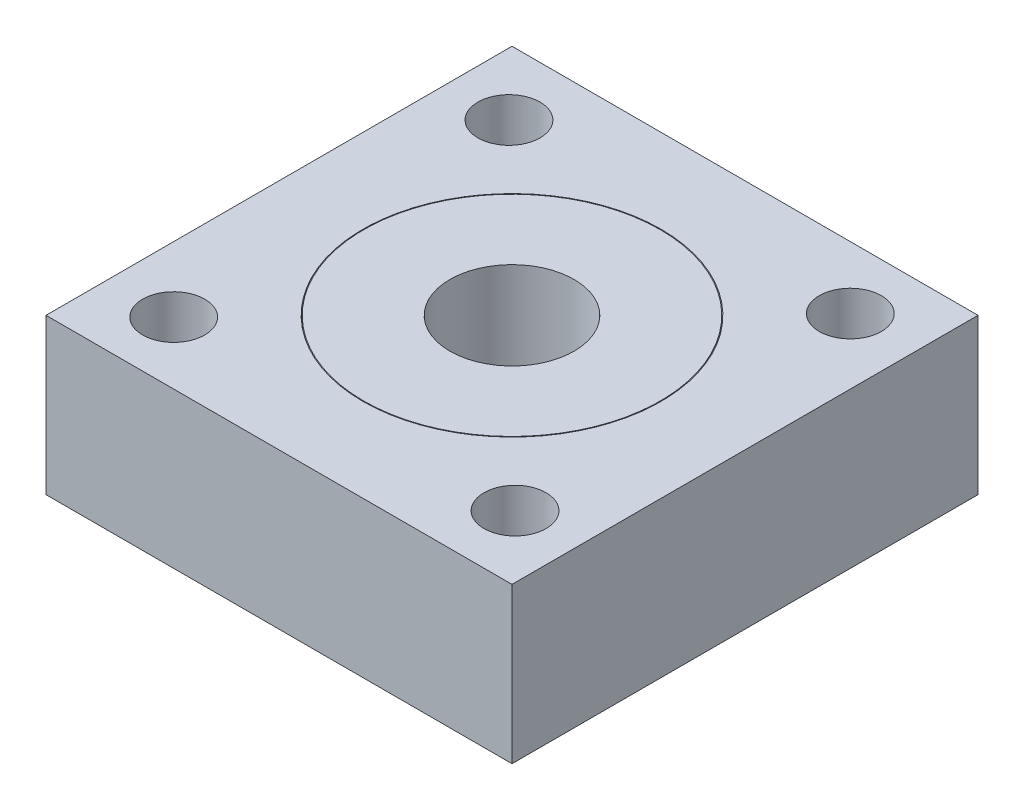
ISO-10303-21;
HEADER;
FILE_DESCRIPTION(('STEP AP214'),'2;1');
FILE_NAME('part.step','',(''),(''),'','','');
FILE_SCHEMA(('AUTOMOTIVE_DESIGN { 1 0 10303 214 1 1 1 1 }'));
ENDSEC;
DATA;
#1=APPLICATION_CONTEXT('core data for automotive mechanical design processes');
#2=APPLICATION_PROTOCOL_DEFINITION('international standard','automotive_design',2000,#1);
#3=PRODUCT_CONTEXT('',#1,'mechanical');
#4=PRODUCT('Part','Part','',(#3));
#5=PRODUCT_RELATED_PRODUCT_CATEGORY('part','',(#4));
#6=PRODUCT_DEFINITION_FORMATION('','',#4);
#7=PRODUCT_DEFINITION_CONTEXT('part definition',#1,'design');
#8=PRODUCT_DEFINITION('design','',#6,#7);
#9=PRODUCT_DEFINITION_SHAPE('','',#8);
#10=(LENGTH_UNIT() NAMED_UNIT(*) SI_UNIT(.MILLI.,.METRE.));
#11=(NAMED_UNIT(*) PLANE_ANGLE_UNIT() SI_UNIT($,.RADIAN.));
#12=(NAMED_UNIT(*) SI_UNIT($,.STERADIAN.) SOLID_ANGLE_UNIT());
#13=UNCERTAINTY_MEASURE_WITH_UNIT(LENGTH_MEASURE(1.E-05),#10,'distance_accuracy_value','');
#14=(GEOMETRIC_REPRESENTATION_CONTEXT(3) GLOBAL_UNCERTAINTY_ASSIGNED_CONTEXT((#13)) GLOBAL_UNIT_ASSIGNED_CONTEXT((#10,
#11,#12)) REPRESENTATION_CONTEXT('',''));
#15=CARTESIAN_POINT('',(0.,0.,0.));
#16=DIRECTION('',(0.,0.,1.));
#17=DIRECTION('',(1.,0.,0.));
#18=AXIS2_PLACEMENT_3D('',#15,#16,#17);
#19=CARTESIAN_POINT('',(15.,10.,-15.));
#20=DIRECTION('',(-1.,0.,0.));
#21=DIRECTION('',(0.,0.,1.));
#22=AXIS2_PLACEMENT_3D('',#19,#20,#21);
#23=PLANE('',#22);
#24=DIRECTION('',(0.,0.,-1.));
#25=VECTOR('',#24,1.);
#26=CARTESIAN_POINT('',(15.,0.,-15.));
#27=LINE('',#26,#25);
#28=CARTESIAN_POINT('',(15.,0.,15.));
#29=VERTEX_POINT('',#28);
#30=CARTESIAN_POINT('',(15.,0.,-15.));
#31=VERTEX_POINT('',#30);
#32=EDGE_CURVE('E101',#29,#31,#27,.T.);
#33=ORIENTED_EDGE('',*,*,#32,.T.);
#34=DIRECTION('',(0.,-1.,0.));
#35=VECTOR('',#34,1.);
#36=CARTESIAN_POINT('',(15.,10.,-15.));
#37=LINE('',#36,#35);
#38=CARTESIAN_POINT('',(15.,10.,-15.));
#39=VERTEX_POINT('',#38);
#40=EDGE_CURVE('E11',#39,#31,#37,.T.);
#41=ORIENTED_EDGE('',*,*,#40,.F.);
#42=DIRECTION('',(0.,0.,-1.));
#43=VECTOR('',#42,1.);
#44=CARTESIAN_POINT('',(15.,10.,-15.));
#45=LINE('',#44,#43);
#46=CARTESIAN_POINT('',(15.,10.,15.));
#47=VERTEX_POINT('',#46);
#48=EDGE_CURVE('E89',#47,#39,#45,.T.);
#49=ORIENTED_EDGE('',*,*,#48,.F.);
#50=DIRECTION('',(0.,-1.,0.));
#51=VECTOR('',#50,1.);
#52=CARTESIAN_POINT('',(15.,10.,15.));
#53=LINE('',#52,#51);
#54=EDGE_CURVE('E97',#47,#29,#53,.T.);
#55=ORIENTED_EDGE('',*,*,#54,.T.);
#56=EDGE_LOOP('',(#33,#41,#49,#55));
#57=FACE_BOUND('',#56,.T.);
#58=ADVANCED_FACE('F38',(#57),#23,.F.);
#59=CARTESIAN_POINT('',(-15.,10.,-15.));
#60=DIRECTION('',(0.,0.,1.));
#61=DIRECTION('',(1.,0.,0.));
#62=AXIS2_PLACEMENT_3D('',#59,#60,#61);
#63=PLANE('',#62);
#64=DIRECTION('',(-1.,0.,0.));
#65=VECTOR('',#64,1.);
#66=CARTESIAN_POINT('',(-15.,0.,-15.));
#67=LINE('',#66,#65);
#68=CARTESIAN_POINT('',(-15.,0.,-15.));
#69=VERTEX_POINT('',#68);
#70=EDGE_CURVE('E93',#31,#69,#67,.T.);
#71=ORIENTED_EDGE('',*,*,#70,.T.);
#72=DIRECTION('',(0.,-1.,0.));
#73=VECTOR('',#72,1.);
#74=CARTESIAN_POINT('',(-15.,10.,-15.));
#75=LINE('',#74,#73);
#76=CARTESIAN_POINT('',(-15.,10.,-15.));
#77=VERTEX_POINT('',#76);
#78=EDGE_CURVE('E46',#77,#69,#75,.T.);
#79=ORIENTED_EDGE('',*,*,#78,.F.);
#80=DIRECTION('',(-1.,0.,0.));
#81=VECTOR('',#80,1.);
#82=CARTESIAN_POINT('',(-15.,10.,-15.));
#83=LINE('',#82,#81);
#84=EDGE_CURVE('E84',#39,#77,#83,.T.);
#85=ORIENTED_EDGE('',*,*,#84,.F.);
#86=ORIENTED_EDGE('',*,*,#40,.T.);
#87=EDGE_LOOP('',(#71,#79,#85,#86));
#88=FACE_BOUND('',#87,.T.);
#89=ADVANCED_FACE('F92',(#88),#63,.F.);
#90=CARTESIAN_POINT('',(-15.,10.,-15.));
#91=DIRECTION('',(1.,0.,0.));
#92=DIRECTION('',(0.,0.,-1.));
#93=AXIS2_PLACEMENT_3D('',#90,#91,#92);
#94=PLANE('',#93);
#95=DIRECTION('',(0.,0.,1.));
#96=VECTOR('',#95,1.);
#97=CARTESIAN_POINT('',(-15.,0.,-15.));
#98=LINE('',#97,#96);
#99=CARTESIAN_POINT('',(-15.,0.,15.));
#100=VERTEX_POINT('',#99);
#101=EDGE_CURVE('E71',#69,#100,#98,.T.);
#102=ORIENTED_EDGE('',*,*,#101,.T.);
#103=DIRECTION('',(0.,-1.,0.));
#104=VECTOR('',#103,1.);
#105=CARTESIAN_POINT('',(-15.,10.,15.));
#106=LINE('',#105,#104);
#107=CARTESIAN_POINT('',(-15.,10.,15.));
#108=VERTEX_POINT('',#107);
#109=EDGE_CURVE('E94',#108,#100,#106,.T.);
#110=ORIENTED_EDGE('',*,*,#109,.F.);
#111=DIRECTION('',(0.,0.,1.));
#112=VECTOR('',#111,1.);
#113=CARTESIAN_POINT('',(-15.,10.,-15.));
#114=LINE('',#113,#112);
#115=EDGE_CURVE('E87',#77,#108,#114,.T.);
#116=ORIENTED_EDGE('',*,*,#115,.F.);
#117=ORIENTED_EDGE('',*,*,#78,.T.);
#118=EDGE_LOOP('',(#102,#110,#116,#117));
#119=FACE_BOUND('',#118,.T.);
#120=ADVANCED_FACE('F95',(#119),#94,.F.);
#121=CARTESIAN_POINT('',(-15.,10.,15.));
#122=DIRECTION('',(0.,0.,-1.));
#123=DIRECTION('',(-1.,0.,0.));
#124=AXIS2_PLACEMENT_3D('',#121,#122,#123);
#125=PLANE('',#124);
#126=DIRECTION('',(1.,0.,0.));
#127=VECTOR('',#126,1.);
#128=CARTESIAN_POINT('',(-15.,0.,15.));
#129=LINE('',#128,#127);
#130=EDGE_CURVE('E77',#100,#29,#129,.T.);
#131=ORIENTED_EDGE('',*,*,#130,.T.);
#132=ORIENTED_EDGE('',*,*,#54,.F.);
#133=DIRECTION('',(1.,0.,0.));
#134=VECTOR('',#133,1.);
#135=CARTESIAN_POINT('',(-15.,10.,15.));
#136=LINE('',#135,#134);
#137=EDGE_CURVE('E54',#108,#47,#136,.T.);
#138=ORIENTED_EDGE('',*,*,#137,.F.);
#139=ORIENTED_EDGE('',*,*,#109,.T.);
#140=EDGE_LOOP('',(#131,#132,#138,#139));
#141=FACE_BOUND('',#140,.T.);
#142=ADVANCED_FACE('F109',(#141),#125,.F.);
#143=CARTESIAN_POINT('',(0.,10.,0.));
#144=DIRECTION('',(0.,1.,0.));
#145=DIRECTION('',(0.,0.,1.));
#146=AXIS2_PLACEMENT_3D('',#143,#144,#145);
#147=PLANE('',#146);
#148=CARTESIAN_POINT('',(-10.9875097580016,10.,-10.7923497267759));
#149=DIRECTION('',(0.,1.,0.));
#150=DIRECTION('',(1.,0.,0.));
#151=AXIS2_PLACEMENT_3D('',#148,#149,#150);
#152=CIRCLE('',#151,2.);
#153=CARTESIAN_POINT('',(-8.98750975800163,10.,-10.7923497267759));
#154=VERTEX_POINT('',#153);
#155=EDGE_CURVE('E136',#154,#154,#152,.T.);
#156=ORIENTED_EDGE('',*,*,#155,.F.);
#157=EDGE_LOOP('',(#156));
#158=FACE_BOUND('',#157,.T.);
#159=CARTESIAN_POINT('',(-10.792349726776,10.,10.9875097580016));
#160=DIRECTION('',(0.,1.,0.));
#161=DIRECTION('',(0.,0.,-1.));
#162=AXIS2_PLACEMENT_3D('',#159,#160,#161);
#163=CIRCLE('',#162,2.);
#164=CARTESIAN_POINT('',(-10.792349726776,10.,8.9875097580016));
#165=VERTEX_POINT('',#164);
#166=EDGE_CURVE('E146',#165,#165,#163,.T.);
#167=ORIENTED_EDGE('',*,*,#166,.F.);
#168=EDGE_LOOP('',(#167));
#169=FACE_BOUND('',#168,.T.);
#170=CARTESIAN_POINT('',(10.9875097580017,10.,10.7923497267758));
#171=DIRECTION('',(0.,1.,0.));
#172=DIRECTION('',(-1.,0.,0.));
#173=AXIS2_PLACEMENT_3D('',#170,#171,#172);
#174=CIRCLE('',#173,2.);
#175=CARTESIAN_POINT('',(8.98750975800171,10.,10.7923497267759));
#176=VERTEX_POINT('',#175);
#177=EDGE_CURVE('E139',#176,#176,#174,.T.);
#178=ORIENTED_EDGE('',*,*,#177,.F.);
#179=EDGE_LOOP('',(#178));
#180=FACE_BOUND('',#179,.T.);
#181=CARTESIAN_POINT('',(10.792349726776,10.,-10.9875097580016));
#182=DIRECTION('',(0.,1.,0.));
#183=DIRECTION('',(0.,0.,1.));
#184=AXIS2_PLACEMENT_3D('',#181,#182,#183);
#185=CIRCLE('',#184,2.);
#186=CARTESIAN_POINT('',(10.792349726776,10.,-8.9875097580016));
#187=VERTEX_POINT('',#186);
#188=EDGE_CURVE('E133',#187,#187,#185,.T.);
#189=ORIENTED_EDGE('',*,*,#188,.F.);
#190=EDGE_LOOP('',(#189));
#191=FACE_BOUND('',#190,.T.);
#192=CARTESIAN_POINT('',(0.,10.,0.));
#193=DIRECTION('',(0.,1.,0.));
#194=DIRECTION('',(0.,0.,1.));
#195=AXIS2_PLACEMENT_3D('',#192,#193,#194);
#196=CIRCLE('',#195,9.6);
#197=CARTESIAN_POINT('',(0.,10.,9.6));
#198=VERTEX_POINT('',#197);
#199=EDGE_CURVE('E115',#198,#198,#196,.T.);
#200=ORIENTED_EDGE('',*,*,#199,.F.);
#201=EDGE_LOOP('',(#200));
#202=FACE_BOUND('',#201,.T.);
#203=ORIENTED_EDGE('',*,*,#48,.T.);
#204=ORIENTED_EDGE('',*,*,#84,.T.);
#205=ORIENTED_EDGE('',*,*,#115,.T.);
#206=ORIENTED_EDGE('',*,*,#137,.T.);
#207=EDGE_LOOP('',(#203,#204,#205,#206));
#208=FACE_BOUND('',#207,.T.);
#209=ADVANCED_FACE('F85',(#158,#169,#180,#191,#202,#208),#147,.T.);
#210=CARTESIAN_POINT('',(0.,0.,0.));
#211=DIRECTION('',(0.,1.,0.));
#212=DIRECTION('',(0.,0.,1.));
#213=AXIS2_PLACEMENT_3D('',#210,#211,#212);
#214=PLANE('',#213);
#215=CARTESIAN_POINT('',(-10.9875097580016,0.,-10.7923497267759));
#216=DIRECTION('',(0.,1.,0.));
#217=DIRECTION('',(1.,0.,0.));
#218=AXIS2_PLACEMENT_3D('',#215,#216,#217);
#219=CIRCLE('',#218,2.);
#220=CARTESIAN_POINT('',(-8.98750975800163,0.,-10.7923497267759));
#221=VERTEX_POINT('',#220);
#222=EDGE_CURVE('E149',#221,#221,#219,.T.);
#223=ORIENTED_EDGE('',*,*,#222,.T.);
#224=EDGE_LOOP('',(#223));
#225=FACE_BOUND('',#224,.T.);
#226=CARTESIAN_POINT('',(-10.792349726776,0.,10.9875097580016));
#227=DIRECTION('',(0.,1.,0.));
#228=DIRECTION('',(0.,0.,-1.));
#229=AXIS2_PLACEMENT_3D('',#226,#227,#228);
#230=CIRCLE('',#229,2.);
#231=CARTESIAN_POINT('',(-10.792349726776,0.,8.9875097580016));
#232=VERTEX_POINT('',#231);
#233=EDGE_CURVE('E142',#232,#232,#230,.T.);
#234=ORIENTED_EDGE('',*,*,#233,.T.);
#235=EDGE_LOOP('',(#234));
#236=FACE_BOUND('',#235,.T.);
#237=CARTESIAN_POINT('',(10.9875097580017,0.,10.7923497267758));
#238=DIRECTION('',(0.,1.,0.));
#239=DIRECTION('',(-1.,0.,0.));
#240=AXIS2_PLACEMENT_3D('',#237,#238,#239);
#241=CIRCLE('',#240,2.);
#242=CARTESIAN_POINT('',(8.98750975800171,0.,10.7923497267759));
#243=VERTEX_POINT('',#242);
#244=EDGE_CURVE('E143',#243,#243,#241,.T.);
#245=ORIENTED_EDGE('',*,*,#244,.T.);
#246=EDGE_LOOP('',(#245));
#247=FACE_BOUND('',#246,.T.);
#248=CARTESIAN_POINT('',(10.792349726776,0.,-10.9875097580016));
#249=DIRECTION('',(0.,1.,0.));
#250=DIRECTION('',(0.,0.,1.));
#251=AXIS2_PLACEMENT_3D('',#248,#249,#250);
#252=CIRCLE('',#251,2.);
#253=CARTESIAN_POINT('',(10.792349726776,0.,-8.9875097580016));
#254=VERTEX_POINT('',#253);
#255=EDGE_CURVE('E130',#254,#254,#252,.T.);
#256=ORIENTED_EDGE('',*,*,#255,.T.);
#257=EDGE_LOOP('',(#256));
#258=FACE_BOUND('',#257,.T.);
#259=ORIENTED_EDGE('',*,*,#32,.F.);
#260=ORIENTED_EDGE('',*,*,#130,.F.);
#261=ORIENTED_EDGE('',*,*,#101,.F.);
#262=ORIENTED_EDGE('',*,*,#70,.F.);
#263=EDGE_LOOP('',(#259,#260,#261,#262));
#264=FACE_BOUND('',#263,.T.);
#265=ADVANCED_FACE('F112',(#225,#236,#247,#258,#264),#214,.F.);
#266=CARTESIAN_POINT('',(0.,3.,0.));
#267=DIRECTION('',(0.,1.,0.));
#268=DIRECTION('',(0.,0.,1.));
#269=AXIS2_PLACEMENT_3D('',#266,#267,#268);
#270=CYLINDRICAL_SURFACE('',#269,9.6);
#271=CARTESIAN_POINT('',(0.,3.,0.));
#272=DIRECTION('',(0.,1.,0.));
#273=DIRECTION('',(0.,0.,1.));
#274=AXIS2_PLACEMENT_3D('',#271,#272,#273);
#275=CIRCLE('',#274,9.6);
#276=CARTESIAN_POINT('',(0.,3.,9.6));
#277=VERTEX_POINT('',#276);
#278=EDGE_CURVE('E104',#277,#277,#275,.T.);
#279=ORIENTED_EDGE('',*,*,#278,.F.);
#280=EDGE_LOOP('',(#279));
#281=FACE_BOUND('',#280,.T.);
#282=ORIENTED_EDGE('',*,*,#199,.T.);
#283=EDGE_LOOP('',(#282));
#284=FACE_BOUND('',#283,.T.);
#285=ADVANCED_FACE('F178',(#281,#284),#270,.F.);
#286=CARTESIAN_POINT('',(0.,3.,0.));
#287=DIRECTION('',(0.,1.,0.));
#288=DIRECTION('',(0.,0.,1.));
#289=AXIS2_PLACEMENT_3D('',#286,#287,#288);
#290=PLANE('',#289);
#291=CARTESIAN_POINT('',(0.,3.,0.));
#292=DIRECTION('',(0.,1.,0.));
#293=DIRECTION('',(0.,0.,1.));
#294=AXIS2_PLACEMENT_3D('',#291,#292,#293);
#295=CIRCLE('',#294,9.55);
#296=CARTESIAN_POINT('',(0.,3.,9.55));
#297=VERTEX_POINT('',#296);
#298=EDGE_CURVE('E118',#297,#297,#295,.T.);
#299=ORIENTED_EDGE('',*,*,#298,.F.);
#300=EDGE_LOOP('',(#299));
#301=FACE_BOUND('',#300,.T.);
#302=ORIENTED_EDGE('',*,*,#278,.T.);
#303=EDGE_LOOP('',(#302));
#304=FACE_BOUND('',#303,.T.);
#305=ADVANCED_FACE('F180',(#301,#304),#290,.T.);
#306=CARTESIAN_POINT('',(0.,3.,0.));
#307=DIRECTION('',(0.,1.,0.));
#308=DIRECTION('',(0.,0.,1.));
#309=AXIS2_PLACEMENT_3D('',#306,#307,#308);
#310=CYLINDRICAL_SURFACE('',#309,9.55);
#311=ORIENTED_EDGE('',*,*,#298,.T.);
#312=EDGE_LOOP('',(#311));
#313=FACE_BOUND('',#312,.T.);
#314=CARTESIAN_POINT('',(0.,10.,0.));
#315=DIRECTION('',(0.,1.,0.));
#316=DIRECTION('',(0.,0.,1.));
#317=AXIS2_PLACEMENT_3D('',#314,#315,#316);
#318=CIRCLE('',#317,9.55);
#319=CARTESIAN_POINT('',(0.,10.,9.55));
#320=VERTEX_POINT('',#319);
#321=EDGE_CURVE('E121',#320,#320,#318,.T.);
#322=ORIENTED_EDGE('',*,*,#321,.F.);
#323=EDGE_LOOP('',(#322));
#324=FACE_BOUND('',#323,.T.);
#325=ADVANCED_FACE('F187',(#313,#324),#310,.T.);
#326=CARTESIAN_POINT('',(0.,10.,0.));
#327=DIRECTION('',(0.,1.,0.));
#328=DIRECTION('',(0.,0.,1.));
#329=AXIS2_PLACEMENT_3D('',#326,#327,#328);
#330=CIRCLE('',#329,4.);
#331=CARTESIAN_POINT('',(0.,10.,4.));
#332=VERTEX_POINT('',#331);
#333=EDGE_CURVE('E127',#332,#332,#330,.T.);
#334=ORIENTED_EDGE('',*,*,#333,.F.);
#335=EDGE_LOOP('',(#334));
#336=FACE_BOUND('',#335,.T.);
#337=ORIENTED_EDGE('',*,*,#321,.T.);
#338=EDGE_LOOP('',(#337));
#339=FACE_BOUND('',#338,.T.);
#340=ADVANCED_FACE('F169',(#336,#339),#147,.T.);
#341=CARTESIAN_POINT('',(0.,3.,0.));
#342=DIRECTION('',(0.,1.,0.));
#343=DIRECTION('',(0.,0.,1.));
#344=AXIS2_PLACEMENT_3D('',#341,#342,#343);
#345=CYLINDRICAL_SURFACE('',#344,4.);
#346=CARTESIAN_POINT('',(0.,3.,0.));
#347=DIRECTION('',(0.,1.,0.));
#348=DIRECTION('',(0.,0.,1.));
#349=AXIS2_PLACEMENT_3D('',#346,#347,#348);
#350=CIRCLE('',#349,4.);
#351=CARTESIAN_POINT('',(0.,3.,4.));
#352=VERTEX_POINT('',#351);
#353=EDGE_CURVE('E124',#352,#352,#350,.T.);
#354=ORIENTED_EDGE('',*,*,#353,.F.);
#355=EDGE_LOOP('',(#354));
#356=FACE_BOUND('',#355,.T.);
#357=ORIENTED_EDGE('',*,*,#333,.T.);
#358=EDGE_LOOP('',(#357));
#359=FACE_BOUND('',#358,.T.);
#360=ADVANCED_FACE('F270',(#356,#359),#345,.F.);
#361=CARTESIAN_POINT('',(0.,3.,0.));
#362=DIRECTION('',(0.,1.,0.));
#363=DIRECTION('',(0.,0.,1.));
#364=AXIS2_PLACEMENT_3D('',#361,#362,#363);
#365=PLANE('',#364);
#366=ORIENTED_EDGE('',*,*,#353,.T.);
#367=EDGE_LOOP('',(#366));
#368=FACE_BOUND('',#367,.T.);
#369=ADVANCED_FACE('F229',(#368),#365,.T.);
#370=CARTESIAN_POINT('',(10.792349726776,0.,-10.9875097580016));
#371=DIRECTION('',(0.,1.,0.));
#372=DIRECTION('',(0.,0.,1.));
#373=AXIS2_PLACEMENT_3D('',#370,#371,#372);
#374=CYLINDRICAL_SURFACE('',#373,2.);
#375=ORIENTED_EDGE('',*,*,#255,.F.);
#376=EDGE_LOOP('',(#375));
#377=FACE_BOUND('',#376,.T.);
#378=ORIENTED_EDGE('',*,*,#188,.T.);
#379=EDGE_LOOP('',(#378));
#380=FACE_BOUND('',#379,.T.);
#381=ADVANCED_FACE('F223',(#377,#380),#374,.F.);
#382=CARTESIAN_POINT('',(10.9875097580017,0.,10.7923497267758));
#383=DIRECTION('',(0.,1.,0.));
#384=DIRECTION('',(-1.,0.,0.));
#385=AXIS2_PLACEMENT_3D('',#382,#383,#384);
#386=CYLINDRICAL_SURFACE('',#385,2.);
#387=ORIENTED_EDGE('',*,*,#244,.F.);
#388=EDGE_LOOP('',(#387));
#389=FACE_BOUND('',#388,.T.);
#390=ORIENTED_EDGE('',*,*,#177,.T.);
#391=EDGE_LOOP('',(#390));
#392=FACE_BOUND('',#391,.T.);
#393=ADVANCED_FACE('F228',(#389,#392),#386,.F.);
#394=CARTESIAN_POINT('',(-10.792349726776,0.,10.9875097580016));
#395=DIRECTION('',(0.,1.,0.));
#396=DIRECTION('',(0.,0.,-1.));
#397=AXIS2_PLACEMENT_3D('',#394,#395,#396);
#398=CYLINDRICAL_SURFACE('',#397,2.);
#399=ORIENTED_EDGE('',*,*,#233,.F.);
#400=EDGE_LOOP('',(#399));
#401=FACE_BOUND('',#400,.T.);
#402=ORIENTED_EDGE('',*,*,#166,.T.);
#403=EDGE_LOOP('',(#402));
#404=FACE_BOUND('',#403,.T.);
#405=ADVANCED_FACE('F162',(#401,#404),#398,.F.);
#406=CARTESIAN_POINT('',(-10.9875097580016,0.,-10.7923497267759));
#407=DIRECTION('',(0.,1.,0.));
#408=DIRECTION('',(1.,0.,0.));
#409=AXIS2_PLACEMENT_3D('',#406,#407,#408);
#410=CYLINDRICAL_SURFACE('',#409,2.);
#411=ORIENTED_EDGE('',*,*,#222,.F.);
#412=EDGE_LOOP('',(#411));
#413=FACE_BOUND('',#412,.T.);
#414=ORIENTED_EDGE('',*,*,#155,.T.);
#415=EDGE_LOOP('',(#414));
#416=FACE_BOUND('',#415,.T.);
#417=ADVANCED_FACE('F159',(#413,#416),#410,.F.);
#418=CLOSED_SHELL('',(#58,#89,#120,#142,#209,#265,#285,#305,#325,#340,#360,#369,#381,#393,#405,#417));
#419=MANIFOLD_SOLID_BREP('B2',#418);
#420=ADVANCED_BREP_SHAPE_REPRESENTATION('',(#18,#419),#14);
#421=SHAPE_DEFINITION_REPRESENTATION(#9,#420);
ENDSEC;
END-ISO-10303-21;
